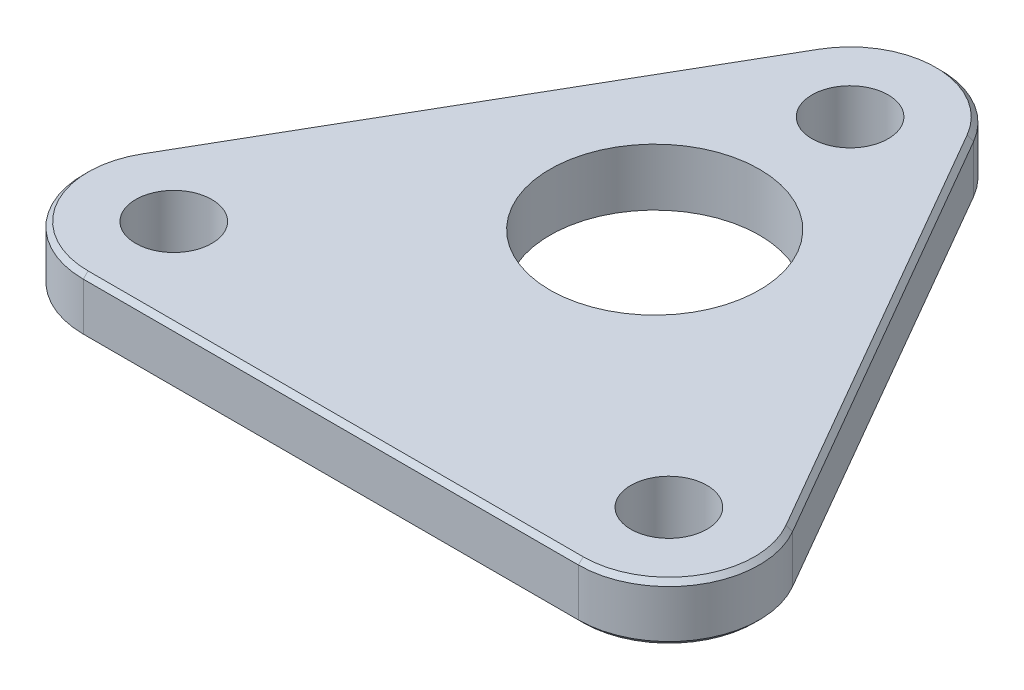
ISO-10303-21;
HEADER;
FILE_DESCRIPTION(('STEP AP214'),'2;1');
FILE_NAME('part.step','',(''),(''),'','','');
FILE_SCHEMA(('AUTOMOTIVE_DESIGN { 1 0 10303 214 1 1 1 1 }'));
ENDSEC;
DATA;
#1=APPLICATION_CONTEXT('core data for automotive mechanical design processes');
#2=APPLICATION_PROTOCOL_DEFINITION('international standard','automotive_design',2000,#1);
#3=PRODUCT_CONTEXT('',#1,'mechanical');
#4=PRODUCT('Part','Part','',(#3));
#5=PRODUCT_RELATED_PRODUCT_CATEGORY('part','',(#4));
#6=PRODUCT_DEFINITION_FORMATION('','',#4);
#7=PRODUCT_DEFINITION_CONTEXT('part definition',#1,'design');
#8=PRODUCT_DEFINITION('design','',#6,#7);
#9=PRODUCT_DEFINITION_SHAPE('','',#8);
#10=(LENGTH_UNIT() NAMED_UNIT(*) SI_UNIT(.MILLI.,.METRE.));
#11=(NAMED_UNIT(*) PLANE_ANGLE_UNIT() SI_UNIT($,.RADIAN.));
#12=(NAMED_UNIT(*) SI_UNIT($,.STERADIAN.) SOLID_ANGLE_UNIT());
#13=UNCERTAINTY_MEASURE_WITH_UNIT(LENGTH_MEASURE(1.E-05),#10,'distance_accuracy_value','');
#14=(GEOMETRIC_REPRESENTATION_CONTEXT(3) GLOBAL_UNCERTAINTY_ASSIGNED_CONTEXT((#13)) GLOBAL_UNIT_ASSIGNED_CONTEXT((#10,
#11,#12)) REPRESENTATION_CONTEXT('',''));
#15=CARTESIAN_POINT('',(0.,0.,0.));
#16=DIRECTION('',(0.,0.,1.));
#17=DIRECTION('',(1.,0.,0.));
#18=AXIS2_PLACEMENT_3D('',#15,#16,#17);
#19=CARTESIAN_POINT('',(-21.2272413359521,6.,-12.2555534994652));
#20=DIRECTION('',(0.866025403784436,0.,0.500000000000004));
#21=DIRECTION('',(0.500000000000004,0.,-0.866025403784436));
#22=AXIS2_PLACEMENT_3D('',#19,#20,#21);
#23=PLANE('',#22);
#24=DIRECTION('',(0.,-1.,0.));
#25=VECTOR('',#24,1.);
#26=CARTESIAN_POINT('',(-8.22724133595206,6.,-34.7722139978605));
#27=LINE('',#26,#25);
#28=CARTESIAN_POINT('',(-8.22724133595206,5.49999999999998,-34.7722139978605));
#29=VERTEX_POINT('',#28);
#30=CARTESIAN_POINT('',(-8.22724133595206,0.5,-34.7722139978605));
#31=VERTEX_POINT('',#30);
#32=EDGE_CURVE('E230',#29,#31,#27,.T.);
#33=ORIENTED_EDGE('',*,*,#32,.T.);
#34=DIRECTION('',(-0.500000000000004,0.,0.866025403784436));
#35=VECTOR('',#34,1.);
#36=CARTESIAN_POINT('',(-21.2272413359521,0.5,-12.2555534994652));
#37=LINE('',#36,#35);
#38=CARTESIAN_POINT('',(-34.2272413359521,0.5,10.2611069989301));
#39=VERTEX_POINT('',#38);
#40=EDGE_CURVE('E201',#31,#39,#37,.T.);
#41=ORIENTED_EDGE('',*,*,#40,.T.);
#42=DIRECTION('',(0.,-1.,0.));
#43=VECTOR('',#42,1.);
#44=CARTESIAN_POINT('',(-34.2272413359521,6.,10.2611069989301));
#45=LINE('',#44,#43);
#46=CARTESIAN_POINT('',(-34.2272413359521,5.49999999999998,10.2611069989301));
#47=VERTEX_POINT('',#46);
#48=EDGE_CURVE('E153',#47,#39,#45,.T.);
#49=ORIENTED_EDGE('',*,*,#48,.F.);
#50=DIRECTION('',(0.500000000000004,0.,-0.866025403784436));
#51=VECTOR('',#50,1.);
#52=CARTESIAN_POINT('',(-8.22724133595202,5.49999999999998,-34.7722139978605));
#53=LINE('',#52,#51);
#54=EDGE_CURVE('E203',#47,#29,#53,.T.);
#55=ORIENTED_EDGE('',*,*,#54,.T.);
#56=EDGE_LOOP('',(#33,#41,#49,#55));
#57=FACE_BOUND('',#56,.T.);
#58=ADVANCED_FACE('F35',(#57),#23,.F.);
#59=CARTESIAN_POINT('',(-25.9999999999999,6.,15.0111069989302));
#60=DIRECTION('',(0.,-1.,0.));
#61=DIRECTION('',(0.,0.,-1.));
#62=AXIS2_PLACEMENT_3D('',#59,#60,#61);
#63=CYLINDRICAL_SURFACE('',#62,9.50000000000001);
#64=ORIENTED_EDGE('',*,*,#48,.T.);
#65=CARTESIAN_POINT('',(-25.9999999999999,0.5,15.0111069989302));
#66=DIRECTION('',(0.,1.,0.));
#67=DIRECTION('',(0.,0.,1.));
#68=AXIS2_PLACEMENT_3D('',#65,#66,#67);
#69=CIRCLE('',#68,9.50000000000001);
#70=CARTESIAN_POINT('',(-25.9999999999999,0.5,24.5111069989302));
#71=VERTEX_POINT('',#70);
#72=EDGE_CURVE('E197',#39,#71,#69,.T.);
#73=ORIENTED_EDGE('',*,*,#72,.T.);
#74=DIRECTION('',(0.,-1.,0.));
#75=VECTOR('',#74,1.);
#76=CARTESIAN_POINT('',(-25.9999999999999,6.,24.5111069989302));
#77=LINE('',#76,#75);
#78=CARTESIAN_POINT('',(-25.9999999999999,5.49999999999999,24.5111069989302));
#79=VERTEX_POINT('',#78);
#80=EDGE_CURVE('E225',#79,#71,#77,.T.);
#81=ORIENTED_EDGE('',*,*,#80,.F.);
#82=CARTESIAN_POINT('',(-25.9999999999999,5.49999999999999,15.0111069989302));
#83=DIRECTION('',(0.,1.,0.));
#84=DIRECTION('',(0.,0.,1.));
#85=AXIS2_PLACEMENT_3D('',#82,#83,#84);
#86=CIRCLE('',#85,9.50000000000001);
#87=EDGE_CURVE('E199',#79,#47,#86,.F.);
#88=ORIENTED_EDGE('',*,*,#87,.T.);
#89=EDGE_LOOP('',(#64,#73,#81,#88));
#90=FACE_BOUND('',#89,.T.);
#91=ADVANCED_FACE('F278',(#90),#63,.T.);
#92=CARTESIAN_POINT('',(0.,6.,24.5111069989302));
#93=DIRECTION('',(0.,0.,-1.));
#94=DIRECTION('',(-1.,0.,0.));
#95=AXIS2_PLACEMENT_3D('',#92,#93,#94);
#96=PLANE('',#95);
#97=ORIENTED_EDGE('',*,*,#80,.T.);
#98=DIRECTION('',(1.,0.,0.));
#99=VECTOR('',#98,1.);
#100=CARTESIAN_POINT('',(0.,0.5,24.5111069989302));
#101=LINE('',#100,#99);
#102=CARTESIAN_POINT('',(25.9999999999999,0.5,24.5111069989302));
#103=VERTEX_POINT('',#102);
#104=EDGE_CURVE('E193',#71,#103,#101,.T.);
#105=ORIENTED_EDGE('',*,*,#104,.T.);
#106=DIRECTION('',(0.,-1.,0.));
#107=VECTOR('',#106,1.);
#108=CARTESIAN_POINT('',(25.9999999999999,6.,24.5111069989302));
#109=LINE('',#108,#107);
#110=CARTESIAN_POINT('',(25.9999999999999,5.49999999999999,24.5111069989302));
#111=VERTEX_POINT('',#110);
#112=EDGE_CURVE('E146',#111,#103,#109,.T.);
#113=ORIENTED_EDGE('',*,*,#112,.F.);
#114=DIRECTION('',(-1.,0.,0.));
#115=VECTOR('',#114,1.);
#116=CARTESIAN_POINT('',(-25.9999999999999,5.49999999999999,24.5111069989302));
#117=LINE('',#116,#115);
#118=EDGE_CURVE('E195',#111,#79,#117,.T.);
#119=ORIENTED_EDGE('',*,*,#118,.T.);
#120=EDGE_LOOP('',(#97,#105,#113,#119));
#121=FACE_BOUND('',#120,.T.);
#122=ADVANCED_FACE('F284',(#121),#96,.F.);
#123=CARTESIAN_POINT('',(25.9999999999999,6.,15.0111069989302));
#124=DIRECTION('',(0.,-1.,0.));
#125=DIRECTION('',(0.,0.,-1.));
#126=AXIS2_PLACEMENT_3D('',#123,#124,#125);
#127=CYLINDRICAL_SURFACE('',#126,9.50000000000001);
#128=ORIENTED_EDGE('',*,*,#112,.T.);
#129=CARTESIAN_POINT('',(25.9999999999999,0.5,15.0111069989302));
#130=DIRECTION('',(0.,1.,0.));
#131=DIRECTION('',(0.,0.,1.));
#132=AXIS2_PLACEMENT_3D('',#129,#130,#131);
#133=CIRCLE('',#132,9.50000000000001);
#134=CARTESIAN_POINT('',(34.2272413359521,0.500000000000001,10.2611069989305));
#135=VERTEX_POINT('',#134);
#136=EDGE_CURVE('E145',#103,#135,#133,.T.);
#137=ORIENTED_EDGE('',*,*,#136,.T.);
#138=DIRECTION('',(0.,-1.,0.));
#139=VECTOR('',#138,1.);
#140=CARTESIAN_POINT('',(34.2272413359521,6.,10.2611069989305));
#141=LINE('',#140,#139);
#142=CARTESIAN_POINT('',(34.2272413359521,5.49999999999999,10.2611069989305));
#143=VERTEX_POINT('',#142);
#144=EDGE_CURVE('E128',#143,#135,#141,.T.);
#145=ORIENTED_EDGE('',*,*,#144,.F.);
#146=CARTESIAN_POINT('',(25.9999999999999,5.49999999999999,15.0111069989302));
#147=DIRECTION('',(0.,1.,0.));
#148=DIRECTION('',(0.,0.,1.));
#149=AXIS2_PLACEMENT_3D('',#146,#147,#148);
#150=CIRCLE('',#149,9.50000000000001);
#151=EDGE_CURVE('E142',#143,#111,#150,.F.);
#152=ORIENTED_EDGE('',*,*,#151,.T.);
#153=EDGE_LOOP('',(#128,#137,#145,#152));
#154=FACE_BOUND('',#153,.T.);
#155=ADVANCED_FACE('F141',(#154),#127,.T.);
#156=CARTESIAN_POINT('',(21.2272413359522,6.,-12.2555534994649));
#157=DIRECTION('',(-0.866025403784443,0.,0.499999999999992));
#158=DIRECTION('',(0.499999999999992,0.,0.866025403784443));
#159=AXIS2_PLACEMENT_3D('',#156,#157,#158);
#160=PLANE('',#159);
#161=ORIENTED_EDGE('',*,*,#144,.T.);
#162=DIRECTION('',(-0.499999999999992,0.,-0.866025403784443));
#163=VECTOR('',#162,1.);
#164=CARTESIAN_POINT('',(21.2272413359522,0.500000000000001,-12.2555534994649));
#165=LINE('',#164,#163);
#166=CARTESIAN_POINT('',(8.2272413359524,0.5,-34.7722139978603));
#167=VERTEX_POINT('',#166);
#168=EDGE_CURVE('E134',#135,#167,#165,.T.);
#169=ORIENTED_EDGE('',*,*,#168,.T.);
#170=DIRECTION('',(0.,-1.,0.));
#171=VECTOR('',#170,1.);
#172=CARTESIAN_POINT('',(8.2272413359524,6.,-34.7722139978603));
#173=LINE('',#172,#171);
#174=CARTESIAN_POINT('',(8.2272413359524,5.49999999999998,-34.7722139978603));
#175=VERTEX_POINT('',#174);
#176=EDGE_CURVE('E130',#175,#167,#173,.T.);
#177=ORIENTED_EDGE('',*,*,#176,.F.);
#178=DIRECTION('',(0.499999999999992,0.,0.866025403784443));
#179=VECTOR('',#178,1.);
#180=CARTESIAN_POINT('',(34.227241335952,5.49999999999998,10.2611069989305));
#181=LINE('',#180,#179);
#182=EDGE_CURVE('E125',#175,#143,#181,.T.);
#183=ORIENTED_EDGE('',*,*,#182,.T.);
#184=EDGE_LOOP('',(#161,#169,#177,#183));
#185=FACE_BOUND('',#184,.T.);
#186=ADVANCED_FACE('F127',(#185),#160,.F.);
#187=CARTESIAN_POINT('',(25.9999999999999,6.,15.0111069989302));
#188=DIRECTION('',(0.,-1.,0.));
#189=DIRECTION('',(0.,0.,-1.));
#190=AXIS2_PLACEMENT_3D('',#187,#188,#189);
#191=CYLINDRICAL_SURFACE('',#190,4.00000000000001);
#192=CARTESIAN_POINT('',(25.9999999999999,6.,15.0111069989302));
#193=DIRECTION('',(0.,1.,0.));
#194=DIRECTION('',(0.,0.,1.));
#195=AXIS2_PLACEMENT_3D('',#192,#193,#194);
#196=CIRCLE('',#195,4.00000000000001);
#197=CARTESIAN_POINT('',(25.9999999999999,6.,19.0111069989302));
#198=VERTEX_POINT('',#197);
#199=EDGE_CURVE('E245',#198,#198,#196,.T.);
#200=ORIENTED_EDGE('',*,*,#199,.T.);
#201=EDGE_LOOP('',(#200));
#202=FACE_BOUND('',#201,.T.);
#203=CARTESIAN_POINT('',(25.9999999999999,0.,15.0111069989302));
#204=DIRECTION('',(0.,1.,0.));
#205=DIRECTION('',(0.,0.,1.));
#206=AXIS2_PLACEMENT_3D('',#203,#204,#205);
#207=CIRCLE('',#206,4.00000000000001);
#208=CARTESIAN_POINT('',(25.9999999999999,0.,19.0111069989302));
#209=VERTEX_POINT('',#208);
#210=EDGE_CURVE('E238',#209,#209,#207,.T.);
#211=ORIENTED_EDGE('',*,*,#210,.F.);
#212=EDGE_LOOP('',(#211));
#213=FACE_BOUND('',#212,.T.);
#214=ADVANCED_FACE('F476',(#202,#213),#191,.F.);
#215=CARTESIAN_POINT('',(0.,6.,-30.0222139978604));
#216=DIRECTION('',(0.,-1.,0.));
#217=DIRECTION('',(0.,0.,-1.));
#218=AXIS2_PLACEMENT_3D('',#215,#216,#217);
#219=CYLINDRICAL_SURFACE('',#218,4.);
#220=CARTESIAN_POINT('',(0.,6.,-30.0222139978604));
#221=DIRECTION('',(0.,1.,0.));
#222=DIRECTION('',(0.,0.,1.));
#223=AXIS2_PLACEMENT_3D('',#220,#221,#222);
#224=CIRCLE('',#223,4.);
#225=CARTESIAN_POINT('',(0.,6.,-26.0222139978604));
#226=VERTEX_POINT('',#225);
#227=EDGE_CURVE('E237',#226,#226,#224,.T.);
#228=ORIENTED_EDGE('',*,*,#227,.T.);
#229=EDGE_LOOP('',(#228));
#230=FACE_BOUND('',#229,.T.);
#231=CARTESIAN_POINT('',(0.,0.,-30.0222139978604));
#232=DIRECTION('',(0.,1.,0.));
#233=DIRECTION('',(0.,0.,1.));
#234=AXIS2_PLACEMENT_3D('',#231,#232,#233);
#235=CIRCLE('',#234,4.);
#236=CARTESIAN_POINT('',(0.,0.,-26.0222139978604));
#237=VERTEX_POINT('',#236);
#238=EDGE_CURVE('E171',#237,#237,#235,.T.);
#239=ORIENTED_EDGE('',*,*,#238,.F.);
#240=EDGE_LOOP('',(#239));
#241=FACE_BOUND('',#240,.T.);
#242=ADVANCED_FACE('F464',(#230,#241),#219,.F.);
#243=CARTESIAN_POINT('',(0.,6.,-30.0222139978604));
#244=DIRECTION('',(0.,-1.,0.));
#245=DIRECTION('',(0.,0.,-1.));
#246=AXIS2_PLACEMENT_3D('',#243,#244,#245);
#247=CYLINDRICAL_SURFACE('',#246,9.5);
#248=ORIENTED_EDGE('',*,*,#176,.T.);
#249=CARTESIAN_POINT('',(0.,0.5,-30.0222139978604));
#250=DIRECTION('',(0.,1.,0.));
#251=DIRECTION('',(0.,0.,1.));
#252=AXIS2_PLACEMENT_3D('',#249,#250,#251);
#253=CIRCLE('',#252,9.5);
#254=EDGE_CURVE('E205',#167,#31,#253,.T.);
#255=ORIENTED_EDGE('',*,*,#254,.T.);
#256=ORIENTED_EDGE('',*,*,#32,.F.);
#257=CARTESIAN_POINT('',(0.,5.49999999999999,-30.0222139978604));
#258=DIRECTION('',(0.,1.,0.));
#259=DIRECTION('',(0.,0.,1.));
#260=AXIS2_PLACEMENT_3D('',#257,#258,#259);
#261=CIRCLE('',#260,9.5);
#262=EDGE_CURVE('E207',#29,#175,#261,.F.);
#263=ORIENTED_EDGE('',*,*,#262,.T.);
#264=EDGE_LOOP('',(#248,#255,#256,#263));
#265=FACE_BOUND('',#264,.T.);
#266=ADVANCED_FACE('F357',(#265),#247,.T.);
#267=CARTESIAN_POINT('',(-25.9999999999999,6.,15.0111069989302));
#268=DIRECTION('',(0.,-1.,0.));
#269=DIRECTION('',(0.,0.,-1.));
#270=AXIS2_PLACEMENT_3D('',#267,#268,#269);
#271=CYLINDRICAL_SURFACE('',#270,4.);
#272=CARTESIAN_POINT('',(-25.9999999999999,6.,15.0111069989302));
#273=DIRECTION('',(0.,1.,0.));
#274=DIRECTION('',(0.,0.,1.));
#275=AXIS2_PLACEMENT_3D('',#272,#273,#274);
#276=CIRCLE('',#275,4.);
#277=CARTESIAN_POINT('',(-25.9999999999999,6.,19.0111069989302));
#278=VERTEX_POINT('',#277);
#279=EDGE_CURVE('E233',#278,#278,#276,.T.);
#280=ORIENTED_EDGE('',*,*,#279,.T.);
#281=EDGE_LOOP('',(#280));
#282=FACE_BOUND('',#281,.T.);
#283=CARTESIAN_POINT('',(-25.9999999999999,0.,15.0111069989302));
#284=DIRECTION('',(0.,1.,0.));
#285=DIRECTION('',(0.,0.,1.));
#286=AXIS2_PLACEMENT_3D('',#283,#284,#285);
#287=CIRCLE('',#286,4.);
#288=CARTESIAN_POINT('',(-25.9999999999999,0.,19.0111069989302));
#289=VERTEX_POINT('',#288);
#290=EDGE_CURVE('E234',#289,#289,#287,.T.);
#291=ORIENTED_EDGE('',*,*,#290,.F.);
#292=EDGE_LOOP('',(#291));
#293=FACE_BOUND('',#292,.T.);
#294=ADVANCED_FACE('F273',(#282,#293),#271,.F.);
#295=CARTESIAN_POINT('',(0.,6.,0.));
#296=DIRECTION('',(0.,1.,0.));
#297=DIRECTION('',(0.,0.,1.));
#298=AXIS2_PLACEMENT_3D('',#295,#296,#297);
#299=PLANE('',#298);
#300=DIRECTION('',(-0.499999999999992,0.,-0.866025403784443));
#301=VECTOR('',#300,1.);
#302=CARTESIAN_POINT('',(7.79422863406027,6.,-34.5222139978603));
#303=LINE('',#302,#301);
#304=CARTESIAN_POINT('',(33.79422863406,6.,10.5111069989304));
#305=VERTEX_POINT('',#304);
#306=CARTESIAN_POINT('',(7.79422863406027,6.,-34.5222139978604));
#307=VERTEX_POINT('',#306);
#308=EDGE_CURVE('E44',#305,#307,#303,.T.);
#309=ORIENTED_EDGE('',*,*,#308,.T.);
#310=CARTESIAN_POINT('',(0.,6.,-30.0222139978604));
#311=DIRECTION('',(0.,1.,0.));
#312=DIRECTION('',(0.,0.,1.));
#313=AXIS2_PLACEMENT_3D('',#310,#311,#312);
#314=CIRCLE('',#313,8.99999999999998);
#315=CARTESIAN_POINT('',(-7.79422863405979,6.,-34.5222139978604));
#316=VERTEX_POINT('',#315);
#317=EDGE_CURVE('E11',#307,#316,#314,.T.);
#318=ORIENTED_EDGE('',*,*,#317,.T.);
#319=DIRECTION('',(-0.500000000000004,0.,0.866025403784436));
#320=VECTOR('',#319,1.);
#321=CARTESIAN_POINT('',(-33.7942286340599,6.,10.5111069989301));
#322=LINE('',#321,#320);
#323=CARTESIAN_POINT('',(-33.7942286340599,6.,10.5111069989301));
#324=VERTEX_POINT('',#323);
#325=EDGE_CURVE('E191',#316,#324,#322,.T.);
#326=ORIENTED_EDGE('',*,*,#325,.T.);
#327=CARTESIAN_POINT('',(-25.9999999999999,6.,15.0111069989302));
#328=DIRECTION('',(0.,1.,0.));
#329=DIRECTION('',(0.,0.,1.));
#330=AXIS2_PLACEMENT_3D('',#327,#328,#329);
#331=CIRCLE('',#330,8.99999999999999);
#332=CARTESIAN_POINT('',(-25.9999999999999,6.,24.0111069989302));
#333=VERTEX_POINT('',#332);
#334=EDGE_CURVE('E189',#324,#333,#331,.T.);
#335=ORIENTED_EDGE('',*,*,#334,.T.);
#336=DIRECTION('',(1.,0.,0.));
#337=VECTOR('',#336,1.);
#338=CARTESIAN_POINT('',(25.9999999999999,6.,24.0111069989302));
#339=LINE('',#338,#337);
#340=CARTESIAN_POINT('',(25.9999999999999,6.,24.0111069989302));
#341=VERTEX_POINT('',#340);
#342=EDGE_CURVE('E187',#333,#341,#339,.T.);
#343=ORIENTED_EDGE('',*,*,#342,.T.);
#344=CARTESIAN_POINT('',(25.9999999999999,6.,15.0111069989302));
#345=DIRECTION('',(0.,1.,0.));
#346=DIRECTION('',(0.,0.,1.));
#347=AXIS2_PLACEMENT_3D('',#344,#345,#346);
#348=CIRCLE('',#347,8.99999999999999);
#349=EDGE_CURVE('E55',#341,#305,#348,.T.);
#350=ORIENTED_EDGE('',*,*,#349,.T.);
#351=EDGE_LOOP('',(#309,#318,#326,#335,#343,#350));
#352=FACE_BOUND('',#351,.T.);
#353=ORIENTED_EDGE('',*,*,#227,.F.);
#354=EDGE_LOOP('',(#353));
#355=FACE_BOUND('',#354,.T.);
#356=ORIENTED_EDGE('',*,*,#199,.F.);
#357=EDGE_LOOP('',(#356));
#358=FACE_BOUND('',#357,.T.);
#359=ORIENTED_EDGE('',*,*,#279,.F.);
#360=EDGE_LOOP('',(#359));
#361=FACE_BOUND('',#360,.T.);
#362=CARTESIAN_POINT('',(0.,6.,-9.5));
#363=DIRECTION('',(0.,1.,0.));
#364=DIRECTION('',(0.,0.,1.));
#365=AXIS2_PLACEMENT_3D('',#362,#363,#364);
#366=CIRCLE('',#365,11.);
#367=CARTESIAN_POINT('',(0.,6.,1.5));
#368=VERTEX_POINT('',#367);
#369=EDGE_CURVE('E167',#368,#368,#366,.F.);
#370=ORIENTED_EDGE('',*,*,#369,.T.);
#371=EDGE_LOOP('',(#370));
#372=FACE_BOUND('',#371,.T.);
#373=ADVANCED_FACE('F262',(#352,#355,#358,#361,#372),#299,.T.);
#374=CARTESIAN_POINT('',(0.,0.,0.));
#375=DIRECTION('',(0.,1.,0.));
#376=DIRECTION('',(0.,0.,1.));
#377=AXIS2_PLACEMENT_3D('',#374,#375,#376);
#378=PLANE('',#377);
#379=DIRECTION('',(0.499999999999992,0.,0.866025403784443));
#380=VECTOR('',#379,1.);
#381=CARTESIAN_POINT('',(20.79422863406,0.,-12.0055534994649));
#382=LINE('',#381,#380);
#383=CARTESIAN_POINT('',(7.79422863406008,0.,-34.5222139978602));
#384=VERTEX_POINT('',#383);
#385=CARTESIAN_POINT('',(33.7942286340598,0.,10.5111069989305));
#386=VERTEX_POINT('',#385);
#387=EDGE_CURVE('E212',#384,#386,#382,.T.);
#388=ORIENTED_EDGE('',*,*,#387,.T.);
#389=CARTESIAN_POINT('',(25.9999999999999,0.,15.0111069989302));
#390=DIRECTION('',(0.,1.,0.));
#391=DIRECTION('',(0.,0.,1.));
#392=AXIS2_PLACEMENT_3D('',#389,#390,#391);
#393=CIRCLE('',#392,9.00000000000001);
#394=CARTESIAN_POINT('',(25.9999999999999,0.,24.0111069989302));
#395=VERTEX_POINT('',#394);
#396=EDGE_CURVE('E135',#386,#395,#393,.F.);
#397=ORIENTED_EDGE('',*,*,#396,.T.);
#398=DIRECTION('',(-1.,0.,0.));
#399=VECTOR('',#398,1.);
#400=CARTESIAN_POINT('',(0.,0.,24.0111069989302));
#401=LINE('',#400,#399);
#402=CARTESIAN_POINT('',(-25.9999999999999,0.,24.0111069989302));
#403=VERTEX_POINT('',#402);
#404=EDGE_CURVE('E220',#395,#403,#401,.T.);
#405=ORIENTED_EDGE('',*,*,#404,.T.);
#406=CARTESIAN_POINT('',(-25.9999999999999,0.,15.0111069989302));
#407=DIRECTION('',(0.,1.,0.));
#408=DIRECTION('',(0.,0.,1.));
#409=AXIS2_PLACEMENT_3D('',#406,#407,#408);
#410=CIRCLE('',#409,9.00000000000001);
#411=CARTESIAN_POINT('',(-33.7942286340598,0.,10.5111069989301));
#412=VERTEX_POINT('',#411);
#413=EDGE_CURVE('E218',#403,#412,#410,.F.);
#414=ORIENTED_EDGE('',*,*,#413,.T.);
#415=DIRECTION('',(0.500000000000004,0.,-0.866025403784436));
#416=VECTOR('',#415,1.);
#417=CARTESIAN_POINT('',(-20.7942286340599,0.,-12.0055534994652));
#418=LINE('',#417,#416);
#419=CARTESIAN_POINT('',(-7.79422863405981,0.,-34.5222139978605));
#420=VERTEX_POINT('',#419);
#421=EDGE_CURVE('E216',#412,#420,#418,.T.);
#422=ORIENTED_EDGE('',*,*,#421,.T.);
#423=CARTESIAN_POINT('',(0.,0.,-30.0222139978604));
#424=DIRECTION('',(0.,1.,0.));
#425=DIRECTION('',(0.,0.,1.));
#426=AXIS2_PLACEMENT_3D('',#423,#424,#425);
#427=CIRCLE('',#426,9.);
#428=EDGE_CURVE('E214',#420,#384,#427,.F.);
#429=ORIENTED_EDGE('',*,*,#428,.T.);
#430=EDGE_LOOP('',(#388,#397,#405,#414,#422,#429));
#431=FACE_BOUND('',#430,.T.);
#432=ORIENTED_EDGE('',*,*,#238,.T.);
#433=EDGE_LOOP('',(#432));
#434=FACE_BOUND('',#433,.T.);
#435=ORIENTED_EDGE('',*,*,#210,.T.);
#436=EDGE_LOOP('',(#435));
#437=FACE_BOUND('',#436,.T.);
#438=ORIENTED_EDGE('',*,*,#290,.T.);
#439=EDGE_LOOP('',(#438));
#440=FACE_BOUND('',#439,.T.);
#441=CARTESIAN_POINT('',(0.,0.,-9.5));
#442=DIRECTION('',(0.,-1.,0.));
#443=DIRECTION('',(0.,0.,-1.));
#444=AXIS2_PLACEMENT_3D('',#441,#442,#443);
#445=CIRCLE('',#444,11.);
#446=CARTESIAN_POINT('',(0.,0.,-20.5));
#447=VERTEX_POINT('',#446);
#448=EDGE_CURVE('E252',#447,#447,#445,.T.);
#449=ORIENTED_EDGE('',*,*,#448,.F.);
#450=EDGE_LOOP('',(#449));
#451=FACE_BOUND('',#450,.T.);
#452=ADVANCED_FACE('F259',(#431,#434,#437,#440,#451),#378,.F.);
#453=CARTESIAN_POINT('',(-21.2272413359521,0.5,-12.2555534994652));
#454=DIRECTION('',(0.612372435695791,0.707106781186549,0.353553390593276));
#455=DIRECTION('',(-0.500000000000004,0.,0.866025403784436));
#456=AXIS2_PLACEMENT_3D('',#453,#454,#455);
#457=PLANE('',#456);
#458=DIRECTION('',(-0.61237243569579,0.707106781186547,-0.353553390593283));
#459=VECTOR('',#458,1.);
#460=CARTESIAN_POINT('',(-7.79422863405981,0.,-34.5222139978605));
#461=LINE('',#460,#459);
#462=EDGE_CURVE('E172',#420,#31,#461,.T.);
#463=ORIENTED_EDGE('',*,*,#462,.F.);
#464=ORIENTED_EDGE('',*,*,#421,.F.);
#465=DIRECTION('',(0.612372435695795,-0.707106781186546,0.353553390593275));
#466=VECTOR('',#465,1.);
#467=CARTESIAN_POINT('',(-34.2272413359521,0.500000000000001,10.26110699893));
#468=LINE('',#467,#466);
#469=EDGE_CURVE('E168',#39,#412,#468,.T.);
#470=ORIENTED_EDGE('',*,*,#469,.F.);
#471=ORIENTED_EDGE('',*,*,#40,.F.);
#472=EDGE_LOOP('',(#463,#464,#470,#471));
#473=FACE_BOUND('',#472,.T.);
#474=ADVANCED_FACE('F261',(#473),#457,.F.);
#475=CARTESIAN_POINT('',(-25.9999999999999,0.5,15.0111069989302));
#476=DIRECTION('',(0.,1.,0.));
#477=DIRECTION('',(0.,0.,1.));
#478=AXIS2_PLACEMENT_3D('',#475,#476,#477);
#479=CONICAL_SURFACE('',#478,9.50000000000001,0.785398163397447);
#480=ORIENTED_EDGE('',*,*,#469,.T.);
#481=ORIENTED_EDGE('',*,*,#413,.F.);
#482=DIRECTION('',(0.,-0.707106781186547,-0.707106781186547));
#483=VECTOR('',#482,1.);
#484=CARTESIAN_POINT('',(-25.9999999999999,0.5,24.5111069989302));
#485=LINE('',#484,#483);
#486=EDGE_CURVE('E175',#71,#403,#485,.T.);
#487=ORIENTED_EDGE('',*,*,#486,.F.);
#488=ORIENTED_EDGE('',*,*,#72,.F.);
#489=EDGE_LOOP('',(#480,#481,#487,#488));
#490=FACE_BOUND('',#489,.T.);
#491=ADVANCED_FACE('F270',(#490),#479,.T.);
#492=CARTESIAN_POINT('',(0.,0.5,-30.0222139978604));
#493=DIRECTION('',(0.,1.,0.));
#494=DIRECTION('',(0.,0.,1.));
#495=AXIS2_PLACEMENT_3D('',#492,#493,#494);
#496=CONICAL_SURFACE('',#495,9.5,0.785398163397448);
#497=ORIENTED_EDGE('',*,*,#462,.T.);
#498=ORIENTED_EDGE('',*,*,#254,.F.);
#499=DIRECTION('',(0.6123724356958,0.707106781186548,-0.353553390593264));
#500=VECTOR('',#499,1.);
#501=CARTESIAN_POINT('',(7.79422863406008,0.,-34.5222139978602));
#502=LINE('',#501,#500);
#503=EDGE_CURVE('E178',#384,#167,#502,.T.);
#504=ORIENTED_EDGE('',*,*,#503,.F.);
#505=ORIENTED_EDGE('',*,*,#428,.F.);
#506=EDGE_LOOP('',(#497,#498,#504,#505));
#507=FACE_BOUND('',#506,.T.);
#508=ADVANCED_FACE('F300',(#507),#496,.T.);
#509=CARTESIAN_POINT('',(0.,0.5,24.5111069989302));
#510=DIRECTION('',(0.,0.70710678118655,-0.707106781186545));
#511=DIRECTION('',(1.,0.,0.));
#512=AXIS2_PLACEMENT_3D('',#509,#510,#511);
#513=PLANE('',#512);
#514=ORIENTED_EDGE('',*,*,#486,.T.);
#515=ORIENTED_EDGE('',*,*,#404,.F.);
#516=DIRECTION('',(0.,-0.707106781186547,-0.707106781186547));
#517=VECTOR('',#516,1.);
#518=CARTESIAN_POINT('',(25.9999999999999,0.5,24.5111069989302));
#519=LINE('',#518,#517);
#520=EDGE_CURVE('E181',#103,#395,#519,.T.);
#521=ORIENTED_EDGE('',*,*,#520,.F.);
#522=ORIENTED_EDGE('',*,*,#104,.F.);
#523=EDGE_LOOP('',(#514,#515,#521,#522));
#524=FACE_BOUND('',#523,.T.);
#525=ADVANCED_FACE('F296',(#524),#513,.F.);
#526=CARTESIAN_POINT('',(21.2272413359522,0.5,-12.2555534994649));
#527=DIRECTION('',(-0.612372435695798,0.707106781186547,0.353553390593269));
#528=DIRECTION('',(-0.499999999999992,0.,-0.866025403784443));
#529=AXIS2_PLACEMENT_3D('',#526,#527,#528);
#530=PLANE('',#529);
#531=ORIENTED_EDGE('',*,*,#503,.T.);
#532=ORIENTED_EDGE('',*,*,#168,.F.);
#533=DIRECTION('',(0.612372435695798,0.707106781186551,-0.35355339059326));
#534=VECTOR('',#533,1.);
#535=CARTESIAN_POINT('',(33.7942286340598,0.,10.5111069989305));
#536=LINE('',#535,#534);
#537=EDGE_CURVE('E183',#386,#135,#536,.T.);
#538=ORIENTED_EDGE('',*,*,#537,.F.);
#539=ORIENTED_EDGE('',*,*,#387,.F.);
#540=EDGE_LOOP('',(#531,#532,#538,#539));
#541=FACE_BOUND('',#540,.T.);
#542=ADVANCED_FACE('F292',(#541),#530,.F.);
#543=CARTESIAN_POINT('',(25.9999999999999,0.5,15.0111069989302));
#544=DIRECTION('',(0.,1.,0.));
#545=DIRECTION('',(0.,0.,1.));
#546=AXIS2_PLACEMENT_3D('',#543,#544,#545);
#547=CONICAL_SURFACE('',#546,9.50000000000001,0.785398163397448);
#548=ORIENTED_EDGE('',*,*,#520,.T.);
#549=ORIENTED_EDGE('',*,*,#396,.F.);
#550=ORIENTED_EDGE('',*,*,#537,.T.);
#551=ORIENTED_EDGE('',*,*,#136,.F.);
#552=EDGE_LOOP('',(#548,#549,#550,#551));
#553=FACE_BOUND('',#552,.T.);
#554=ADVANCED_FACE('F289',(#553),#547,.T.);
#555=CARTESIAN_POINT('',(0.,6.,24.0111069989302));
#556=DIRECTION('',(0.,0.70710678118655,0.707106781186545));
#557=DIRECTION('',(-1.,0.,0.));
#558=AXIS2_PLACEMENT_3D('',#555,#556,#557);
#559=PLANE('',#558);
#560=DIRECTION('',(0.,0.707106781186545,-0.70710678118655));
#561=VECTOR('',#560,1.);
#562=CARTESIAN_POINT('',(-25.9999999999999,5.49999999999999,24.5111069989302));
#563=LINE('',#562,#561);
#564=EDGE_CURVE('E156',#79,#333,#563,.T.);
#565=ORIENTED_EDGE('',*,*,#564,.F.);
#566=ORIENTED_EDGE('',*,*,#118,.F.);
#567=DIRECTION('',(0.,-0.707106781186545,0.70710678118655));
#568=VECTOR('',#567,1.);
#569=CARTESIAN_POINT('',(25.9999999999999,6.,24.0111069989302));
#570=LINE('',#569,#568);
#571=EDGE_CURVE('E39',#341,#111,#570,.T.);
#572=ORIENTED_EDGE('',*,*,#571,.F.);
#573=ORIENTED_EDGE('',*,*,#342,.F.);
#574=EDGE_LOOP('',(#565,#566,#572,#573));
#575=FACE_BOUND('',#574,.T.);
#576=ADVANCED_FACE('F37',(#575),#559,.T.);
#577=CARTESIAN_POINT('',(25.9999999999999,6.,15.0111069989302));
#578=DIRECTION('',(0.,-1.,0.));
#579=DIRECTION('',(0.,0.,-1.));
#580=AXIS2_PLACEMENT_3D('',#577,#578,#579);
#581=CONICAL_SURFACE('',#580,8.99999999999999,0.785398163397454);
#582=ORIENTED_EDGE('',*,*,#571,.T.);
#583=ORIENTED_EDGE('',*,*,#151,.F.);
#584=DIRECTION('',(0.612372435695797,-0.707106781186545,-0.353553390593275));
#585=VECTOR('',#584,1.);
#586=CARTESIAN_POINT('',(33.79422863406,6.,10.5111069989304));
#587=LINE('',#586,#585);
#588=EDGE_CURVE('E151',#305,#143,#587,.T.);
#589=ORIENTED_EDGE('',*,*,#588,.F.);
#590=ORIENTED_EDGE('',*,*,#349,.F.);
#591=EDGE_LOOP('',(#582,#583,#589,#590));
#592=FACE_BOUND('',#591,.T.);
#593=ADVANCED_FACE('F150',(#592),#581,.T.);
#594=CARTESIAN_POINT('',(-25.9999999999999,6.,15.0111069989302));
#595=DIRECTION('',(0.,-1.,0.));
#596=DIRECTION('',(0.,0.,-1.));
#597=AXIS2_PLACEMENT_3D('',#594,#595,#596);
#598=CONICAL_SURFACE('',#597,8.99999999999999,0.785398163397452);
#599=ORIENTED_EDGE('',*,*,#564,.T.);
#600=ORIENTED_EDGE('',*,*,#334,.F.);
#601=DIRECTION('',(0.612372435695796,0.707106781186543,0.353553390593279));
#602=VECTOR('',#601,1.);
#603=CARTESIAN_POINT('',(-34.227241335952,5.49999999999999,10.2611069989301));
#604=LINE('',#603,#602);
#605=EDGE_CURVE('E157',#47,#324,#604,.T.);
#606=ORIENTED_EDGE('',*,*,#605,.F.);
#607=ORIENTED_EDGE('',*,*,#87,.F.);
#608=EDGE_LOOP('',(#599,#600,#606,#607));
#609=FACE_BOUND('',#608,.T.);
#610=ADVANCED_FACE('F318',(#609),#598,.T.);
#611=CARTESIAN_POINT('',(20.79422863406,6.,-12.0055534994649));
#612=DIRECTION('',(0.612372435695797,0.707106781186548,-0.353553390593268));
#613=DIRECTION('',(0.499999999999992,0.,0.866025403784443));
#614=AXIS2_PLACEMENT_3D('',#611,#612,#613);
#615=PLANE('',#614);
#616=ORIENTED_EDGE('',*,*,#588,.T.);
#617=ORIENTED_EDGE('',*,*,#182,.F.);
#618=DIRECTION('',(0.6123724356958,-0.707106781186552,-0.353553390593256));
#619=VECTOR('',#618,1.);
#620=CARTESIAN_POINT('',(7.79422863406027,6.,-34.5222139978604));
#621=LINE('',#620,#619);
#622=EDGE_CURVE('E161',#307,#175,#621,.T.);
#623=ORIENTED_EDGE('',*,*,#622,.F.);
#624=ORIENTED_EDGE('',*,*,#308,.F.);
#625=EDGE_LOOP('',(#616,#617,#623,#624));
#626=FACE_BOUND('',#625,.T.);
#627=ADVANCED_FACE('F155',(#626),#615,.T.);
#628=CARTESIAN_POINT('',(-20.7942286340598,6.,-12.0055534994652));
#629=DIRECTION('',(-0.61237243569579,0.707106781186551,-0.353553390593275));
#630=DIRECTION('',(0.500000000000004,0.,-0.866025403784436));
#631=AXIS2_PLACEMENT_3D('',#628,#629,#630);
#632=PLANE('',#631);
#633=ORIENTED_EDGE('',*,*,#605,.T.);
#634=ORIENTED_EDGE('',*,*,#325,.F.);
#635=DIRECTION('',(0.612372435695793,0.707106781186545,0.353553390593281));
#636=VECTOR('',#635,1.);
#637=CARTESIAN_POINT('',(-8.22724133595203,5.49999999999998,-34.7722139978605));
#638=LINE('',#637,#636);
#639=EDGE_CURVE('E165',#29,#316,#638,.T.);
#640=ORIENTED_EDGE('',*,*,#639,.F.);
#641=ORIENTED_EDGE('',*,*,#54,.F.);
#642=EDGE_LOOP('',(#633,#634,#640,#641));
#643=FACE_BOUND('',#642,.T.);
#644=ADVANCED_FACE('F311',(#643),#632,.T.);
#645=CARTESIAN_POINT('',(0.,6.,-30.0222139978604));
#646=DIRECTION('',(0.,-1.,0.));
#647=DIRECTION('',(0.,0.,-1.));
#648=AXIS2_PLACEMENT_3D('',#645,#646,#647);
#649=CONICAL_SURFACE('',#648,8.99999999999998,0.785398163397452);
#650=ORIENTED_EDGE('',*,*,#622,.T.);
#651=ORIENTED_EDGE('',*,*,#262,.F.);
#652=ORIENTED_EDGE('',*,*,#639,.T.);
#653=ORIENTED_EDGE('',*,*,#317,.F.);
#654=EDGE_LOOP('',(#650,#651,#652,#653));
#655=FACE_BOUND('',#654,.T.);
#656=ADVANCED_FACE('F308',(#655),#649,.T.);
#657=CARTESIAN_POINT('',(0.,42.7695526217005,-9.5));
#658=DIRECTION('',(0.,-1.,0.));
#659=DIRECTION('',(0.,0.,-1.));
#660=AXIS2_PLACEMENT_3D('',#657,#658,#659);
#661=CYLINDRICAL_SURFACE('',#660,11.);
#662=ORIENTED_EDGE('',*,*,#448,.T.);
#663=EDGE_LOOP('',(#662));
#664=FACE_BOUND('',#663,.T.);
#665=ORIENTED_EDGE('',*,*,#369,.F.);
#666=EDGE_LOOP('',(#665));
#667=FACE_BOUND('',#666,.T.);
#668=ADVANCED_FACE('F256',(#664,#667),#661,.F.);
#669=CLOSED_SHELL('',(#58,#91,#122,#155,#186,#214,#242,#266,#294,#373,#452,#474,#491,#508,#525,
#542,#554,#576,#593,#610,#627,#644,#656,#668));
#670=MANIFOLD_SOLID_BREP('B2',#669);
#671=ADVANCED_BREP_SHAPE_REPRESENTATION('',(#18,#670),#14);
#672=SHAPE_DEFINITION_REPRESENTATION(#9,#671);
ENDSEC;
END-ISO-10303-21;
